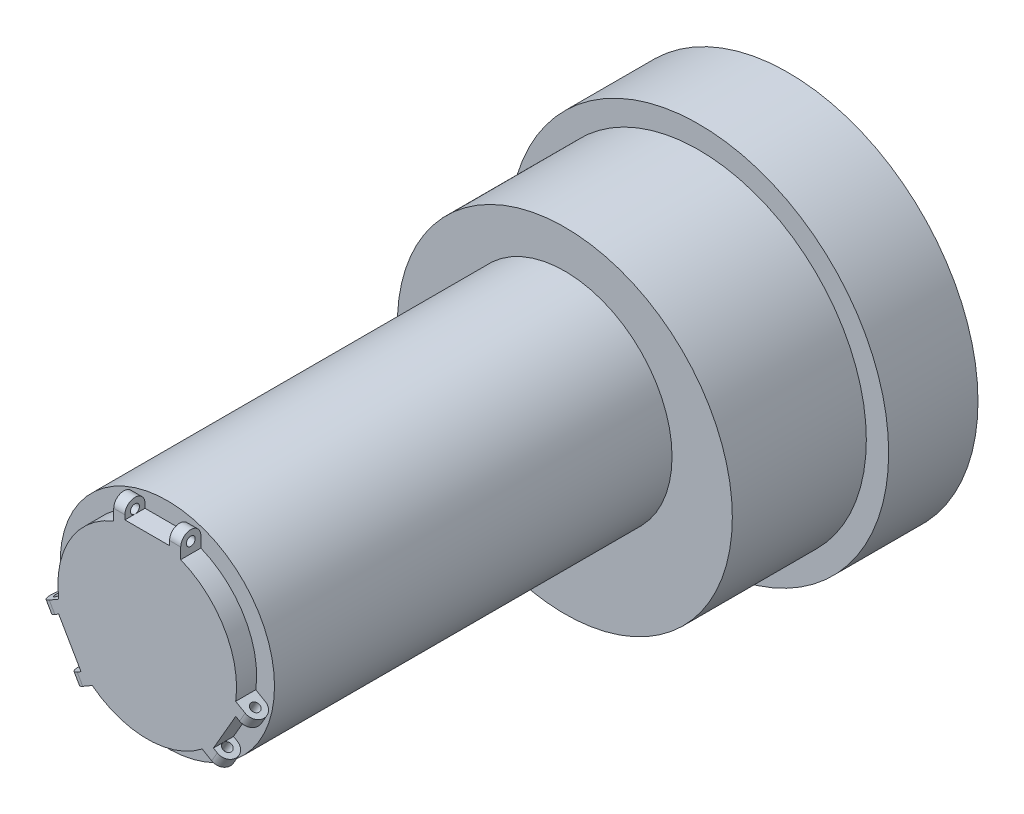
ISO-10303-21;
HEADER;
FILE_DESCRIPTION(('STEP AP214'),'2;1');
FILE_NAME('part.step','',(''),(''),'','','');
FILE_SCHEMA(('AUTOMOTIVE_DESIGN { 1 0 10303 214 1 1 1 1 }'));
ENDSEC;
DATA;
#1=APPLICATION_CONTEXT('core data for automotive mechanical design processes');
#2=APPLICATION_PROTOCOL_DEFINITION('international standard','automotive_design',2000,#1);
#3=PRODUCT_CONTEXT('',#1,'mechanical');
#4=PRODUCT('Part','Part','',(#3));
#5=PRODUCT_RELATED_PRODUCT_CATEGORY('part','',(#4));
#6=PRODUCT_DEFINITION_FORMATION('','',#4);
#7=PRODUCT_DEFINITION_CONTEXT('part definition',#1,'design');
#8=PRODUCT_DEFINITION('design','',#6,#7);
#9=PRODUCT_DEFINITION_SHAPE('','',#8);
#10=(LENGTH_UNIT() NAMED_UNIT(*) SI_UNIT(.MILLI.,.METRE.));
#11=(NAMED_UNIT(*) PLANE_ANGLE_UNIT() SI_UNIT($,.RADIAN.));
#12=(NAMED_UNIT(*) SI_UNIT($,.STERADIAN.) SOLID_ANGLE_UNIT());
#13=UNCERTAINTY_MEASURE_WITH_UNIT(LENGTH_MEASURE(1.E-05),#10,'distance_accuracy_value','');
#14=(GEOMETRIC_REPRESENTATION_CONTEXT(3) GLOBAL_UNCERTAINTY_ASSIGNED_CONTEXT((#13)) GLOBAL_UNIT_ASSIGNED_CONTEXT((#10,
#11,#12)) REPRESENTATION_CONTEXT('',''));
#15=CARTESIAN_POINT('',(0.,0.,0.));
#16=DIRECTION('',(0.,0.,1.));
#17=DIRECTION('',(1.,0.,0.));
#18=AXIS2_PLACEMENT_3D('',#15,#16,#17);
#19=CARTESIAN_POINT('',(7.49999999999999,26.,141.25));
#20=DIRECTION('',(-1.,0.,0.));
#21=DIRECTION('',(0.,-1.,0.));
#22=AXIS2_PLACEMENT_3D('',#19,#20,#21);
#23=CYLINDRICAL_SURFACE('',#22,2.25);
#24=CARTESIAN_POINT('',(-5.,26.,141.25));
#25=DIRECTION('',(-1.,0.,0.));
#26=DIRECTION('',(0.,-1.,0.));
#27=AXIS2_PLACEMENT_3D('',#24,#25,#26);
#28=CIRCLE('',#27,2.25);
#29=CARTESIAN_POINT('',(-5.,26.,139.));
#30=VERTEX_POINT('',#29);
#31=CARTESIAN_POINT('',(-5.,26.,143.5));
#32=VERTEX_POINT('',#31);
#33=EDGE_CURVE('E236',#30,#32,#28,.F.);
#34=ORIENTED_EDGE('',*,*,#33,.F.);
#35=DIRECTION('',(-1.,0.,0.));
#36=VECTOR('',#35,1.);
#37=CARTESIAN_POINT('',(7.49999999999999,26.,139.));
#38=LINE('',#37,#36);
#39=CARTESIAN_POINT('',(-7.50000000000001,26.,139.));
#40=VERTEX_POINT('',#39);
#41=EDGE_CURVE('E337',#30,#40,#38,.T.);
#42=ORIENTED_EDGE('',*,*,#41,.T.);
#43=CARTESIAN_POINT('',(-7.50000000000001,26.,141.25));
#44=DIRECTION('',(-1.,0.,0.));
#45=DIRECTION('',(0.,-1.,0.));
#46=AXIS2_PLACEMENT_3D('',#43,#44,#45);
#47=CIRCLE('',#46,2.25);
#48=CARTESIAN_POINT('',(-7.50000000000001,26.,143.5));
#49=VERTEX_POINT('',#48);
#50=EDGE_CURVE('E323',#49,#40,#47,.T.);
#51=ORIENTED_EDGE('',*,*,#50,.F.);
#52=DIRECTION('',(-1.,0.,0.));
#53=VECTOR('',#52,1.);
#54=CARTESIAN_POINT('',(7.49999999999999,26.,143.5));
#55=LINE('',#54,#53);
#56=EDGE_CURVE('E331',#32,#49,#55,.T.);
#57=ORIENTED_EDGE('',*,*,#56,.F.);
#58=EDGE_LOOP('',(#34,#42,#51,#57));
#59=FACE_BOUND('',#58,.T.);
#60=ADVANCED_FACE('F32',(#59),#23,.T.);
#61=CARTESIAN_POINT('',(42.5,26.,141.25));
#62=DIRECTION('',(-1.,0.,0.));
#63=DIRECTION('',(0.,-1.,0.));
#64=AXIS2_PLACEMENT_3D('',#61,#62,#63);
#65=CYLINDRICAL_SURFACE('',#64,0.999999999999998);
#66=CARTESIAN_POINT('',(5.,26.,141.25));
#67=DIRECTION('',(1.,0.,0.));
#68=DIRECTION('',(0.,0.,-1.));
#69=AXIS2_PLACEMENT_3D('',#66,#67,#68);
#70=CIRCLE('',#69,0.999999999999998);
#71=CARTESIAN_POINT('',(5.,25.,141.25));
#72=VERTEX_POINT('',#71);
#73=EDGE_CURVE('E11',#72,#72,#70,.F.);
#74=ORIENTED_EDGE('',*,*,#73,.T.);
#75=EDGE_LOOP('',(#74));
#76=FACE_BOUND('',#75,.T.);
#77=CARTESIAN_POINT('',(7.49999999999999,26.,141.25));
#78=DIRECTION('',(1.,0.,0.));
#79=DIRECTION('',(0.,1.,0.));
#80=AXIS2_PLACEMENT_3D('',#77,#78,#79);
#81=CIRCLE('',#80,0.999999999999998);
#82=CARTESIAN_POINT('',(7.49999999999999,27.,141.25));
#83=VERTEX_POINT('',#82);
#84=EDGE_CURVE('E310',#83,#83,#81,.T.);
#85=ORIENTED_EDGE('',*,*,#84,.T.);
#86=EDGE_LOOP('',(#85));
#87=FACE_BOUND('',#86,.T.);
#88=ADVANCED_FACE('F524',(#76,#87),#65,.F.);
#89=CARTESIAN_POINT('',(14.4365334794732,-11.9951905283833,141.25));
#90=DIRECTION('',(0.5,0.866025403784438,0.));
#91=DIRECTION('',(-0.866025403784439,0.5,0.));
#92=AXIS2_PLACEMENT_3D('',#89,#90,#91);
#93=CYLINDRICAL_SURFACE('',#92,2.24999999999997);
#94=CARTESIAN_POINT('',(20.6865334794732,-1.16987298107785,141.25));
#95=DIRECTION('',(0.5,0.866025403784439,0.));
#96=DIRECTION('',(-0.866025403784439,0.5,0.));
#97=AXIS2_PLACEMENT_3D('',#94,#95,#96);
#98=CIRCLE('',#97,2.24999999999997);
#99=CARTESIAN_POINT('',(20.6865334794732,-1.16987298107785,139.));
#100=VERTEX_POINT('',#99);
#101=CARTESIAN_POINT('',(20.6865334794732,-1.16987298107785,143.5));
#102=VERTEX_POINT('',#101);
#103=EDGE_CURVE('E268',#100,#102,#98,.F.);
#104=ORIENTED_EDGE('',*,*,#103,.F.);
#105=DIRECTION('',(0.5,0.866025403784438,0.));
#106=VECTOR('',#105,1.);
#107=CARTESIAN_POINT('',(14.4365334794732,-11.9951905283833,139.));
#108=LINE('',#107,#106);
#109=CARTESIAN_POINT('',(21.9365334794732,0.995190528383271,139.));
#110=VERTEX_POINT('',#109);
#111=EDGE_CURVE('E351',#100,#110,#108,.T.);
#112=ORIENTED_EDGE('',*,*,#111,.T.);
#113=CARTESIAN_POINT('',(21.9365334794732,0.995190528383271,141.25));
#114=DIRECTION('',(0.5,0.866025403784439,0.));
#115=DIRECTION('',(-0.866025403784438,0.5,0.));
#116=AXIS2_PLACEMENT_3D('',#113,#114,#115);
#117=CIRCLE('',#116,2.24999999999997);
#118=CARTESIAN_POINT('',(21.9365334794732,0.995190528383271,143.5));
#119=VERTEX_POINT('',#118);
#120=EDGE_CURVE('E336',#119,#110,#117,.T.);
#121=ORIENTED_EDGE('',*,*,#120,.F.);
#122=DIRECTION('',(0.5,0.866025403784438,0.));
#123=VECTOR('',#122,1.);
#124=CARTESIAN_POINT('',(14.4365334794732,-11.9951905283833,143.5));
#125=LINE('',#124,#123);
#126=EDGE_CURVE('E344',#102,#119,#125,.T.);
#127=ORIENTED_EDGE('',*,*,#126,.F.);
#128=EDGE_LOOP('',(#104,#112,#121,#127));
#129=FACE_BOUND('',#128,.T.);
#130=ADVANCED_FACE('F504',(#129),#93,.T.);
#131=CARTESIAN_POINT('',(-13.0065698604072,-59.5280398304194,141.25));
#132=DIRECTION('',(0.5,0.866025403784438,0.));
#133=DIRECTION('',(-0.866025403784439,0.5,0.));
#134=AXIS2_PLACEMENT_3D('',#131,#132,#133);
#135=CYLINDRICAL_SURFACE('',#134,1.00000000000001);
#136=CARTESIAN_POINT('',(20.6865334794732,-1.16987298107784,141.25));
#137=DIRECTION('',(0.5,0.866025403784439,0.));
#138=DIRECTION('',(-0.866025403784439,0.5,0.));
#139=AXIS2_PLACEMENT_3D('',#136,#137,#138);
#140=CIRCLE('',#139,1.00000000000001);
#141=CARTESIAN_POINT('',(19.8205080756887,-0.669872981077853,141.25));
#142=VERTEX_POINT('',#141);
#143=EDGE_CURVE('E441',#142,#142,#140,.F.);
#144=ORIENTED_EDGE('',*,*,#143,.T.);
#145=EDGE_LOOP('',(#144));
#146=FACE_BOUND('',#145,.T.);
#147=CARTESIAN_POINT('',(21.9365334794732,0.995190528383268,141.25));
#148=DIRECTION('',(0.5,0.866025403784439,0.));
#149=DIRECTION('',(-0.866025403784438,0.5,0.));
#150=AXIS2_PLACEMENT_3D('',#147,#148,#149);
#151=CIRCLE('',#150,1.00000000000001);
#152=CARTESIAN_POINT('',(21.0705080756888,1.49519052838327,141.25));
#153=VERTEX_POINT('',#152);
#154=EDGE_CURVE('E297',#153,#153,#151,.T.);
#155=ORIENTED_EDGE('',*,*,#154,.T.);
#156=EDGE_LOOP('',(#155));
#157=FACE_BOUND('',#156,.T.);
#158=ADVANCED_FACE('F547',(#146,#157),#135,.F.);
#159=CARTESIAN_POINT('',(-21.9365334794733,0.995190528383349,141.25));
#160=DIRECTION('',(0.5,-0.866025403784439,0.));
#161=DIRECTION('',(0.866025403784439,0.5,0.));
#162=AXIS2_PLACEMENT_3D('',#159,#160,#161);
#163=CYLINDRICAL_SURFACE('',#162,2.25000000000003);
#164=CARTESIAN_POINT('',(-15.6865334794733,-9.83012701892214,141.25));
#165=DIRECTION('',(0.5,-0.866025403784439,0.));
#166=DIRECTION('',(0.866025403784439,0.5,0.));
#167=AXIS2_PLACEMENT_3D('',#164,#165,#166);
#168=CIRCLE('',#167,2.25000000000003);
#169=CARTESIAN_POINT('',(-15.6865334794733,-9.83012701892215,139.));
#170=VERTEX_POINT('',#169);
#171=CARTESIAN_POINT('',(-15.6865334794733,-9.83012701892214,143.5));
#172=VERTEX_POINT('',#171);
#173=EDGE_CURVE('E295',#170,#172,#168,.F.);
#174=ORIENTED_EDGE('',*,*,#173,.F.);
#175=DIRECTION('',(0.5,-0.866025403784439,0.));
#176=VECTOR('',#175,1.);
#177=CARTESIAN_POINT('',(-21.9365334794733,0.995190528383349,139.));
#178=LINE('',#177,#176);
#179=CARTESIAN_POINT('',(-14.4365334794733,-11.9951905283832,139.));
#180=VERTEX_POINT('',#179);
#181=EDGE_CURVE('E324',#170,#180,#178,.T.);
#182=ORIENTED_EDGE('',*,*,#181,.T.);
#183=CARTESIAN_POINT('',(-14.4365334794733,-11.9951905283832,141.25));
#184=DIRECTION('',(0.5,-0.866025403784439,0.));
#185=DIRECTION('',(0.866025403784439,0.5,0.));
#186=AXIS2_PLACEMENT_3D('',#183,#184,#185);
#187=CIRCLE('',#186,2.25000000000003);
#188=CARTESIAN_POINT('',(-14.4365334794733,-11.9951905283832,143.5));
#189=VERTEX_POINT('',#188);
#190=EDGE_CURVE('E313',#189,#180,#187,.T.);
#191=ORIENTED_EDGE('',*,*,#190,.F.);
#192=DIRECTION('',(0.5,-0.866025403784439,0.));
#193=VECTOR('',#192,1.);
#194=CARTESIAN_POINT('',(-21.9365334794733,0.995190528383349,143.5));
#195=LINE('',#194,#193);
#196=EDGE_CURVE('E317',#172,#189,#195,.T.);
#197=ORIENTED_EDGE('',*,*,#196,.F.);
#198=EDGE_LOOP('',(#174,#182,#191,#197));
#199=FACE_BOUND('',#198,.T.);
#200=ADVANCED_FACE('F540',(#199),#163,.T.);
#201=CARTESIAN_POINT('',(-45.0495098004315,41.0280398304193,141.25));
#202=DIRECTION('',(0.5,-0.866025403784439,0.));
#203=DIRECTION('',(0.866025403784439,0.5,0.));
#204=AXIS2_PLACEMENT_3D('',#201,#202,#203);
#205=CYLINDRICAL_SURFACE('',#204,0.999999999999999);
#206=CARTESIAN_POINT('',(-15.6865334794733,-9.83012701892215,141.25));
#207=DIRECTION('',(0.5,-0.866025403784439,0.));
#208=DIRECTION('',(0.866025403784439,0.5,0.));
#209=AXIS2_PLACEMENT_3D('',#206,#207,#208);
#210=CIRCLE('',#209,0.999999999999999);
#211=CARTESIAN_POINT('',(-14.8205080756888,-9.33012701892214,141.25));
#212=VERTEX_POINT('',#211);
#213=EDGE_CURVE('E435',#212,#212,#210,.F.);
#214=ORIENTED_EDGE('',*,*,#213,.T.);
#215=EDGE_LOOP('',(#214));
#216=FACE_BOUND('',#215,.T.);
#217=CARTESIAN_POINT('',(-14.4365334794733,-11.9951905283832,141.25));
#218=DIRECTION('',(0.5,-0.866025403784439,0.));
#219=DIRECTION('',(0.866025403784439,0.5,0.));
#220=AXIS2_PLACEMENT_3D('',#217,#218,#219);
#221=CIRCLE('',#220,0.999999999999999);
#222=CARTESIAN_POINT('',(-13.5705080756888,-11.4951905283832,141.25));
#223=VERTEX_POINT('',#222);
#224=EDGE_CURVE('E303',#223,#223,#221,.T.);
#225=ORIENTED_EDGE('',*,*,#224,.T.);
#226=EDGE_LOOP('',(#225));
#227=FACE_BOUND('',#226,.T.);
#228=ADVANCED_FACE('F546',(#216,#227),#205,.F.);
#229=CARTESIAN_POINT('',(0.,5.00000000000001,139.));
#230=DIRECTION('',(0.,0.,1.));
#231=DIRECTION('',(1.,0.,0.));
#232=AXIS2_PLACEMENT_3D('',#229,#230,#231);
#233=PLANE('',#232);
#234=ORIENTED_EDGE('',*,*,#41,.F.);
#235=DIRECTION('',(0.,1.,0.));
#236=VECTOR('',#235,1.);
#237=CARTESIAN_POINT('',(-5.,25.,139.));
#238=LINE('',#237,#236);
#239=CARTESIAN_POINT('',(-5.,25.,139.));
#240=VERTEX_POINT('',#239);
#241=EDGE_CURVE('E221',#240,#30,#238,.T.);
#242=ORIENTED_EDGE('',*,*,#241,.F.);
#243=DIRECTION('',(-1.,0.,0.));
#244=VECTOR('',#243,1.);
#245=CARTESIAN_POINT('',(-5.,25.,139.));
#246=LINE('',#245,#244);
#247=CARTESIAN_POINT('',(5.,25.,139.));
#248=VERTEX_POINT('',#247);
#249=EDGE_CURVE('E213',#248,#240,#246,.T.);
#250=ORIENTED_EDGE('',*,*,#249,.F.);
#251=DIRECTION('',(0.,1.,0.));
#252=VECTOR('',#251,1.);
#253=CARTESIAN_POINT('',(5.,25.,139.));
#254=LINE('',#253,#252);
#255=CARTESIAN_POINT('',(5.,26.,139.));
#256=VERTEX_POINT('',#255);
#257=EDGE_CURVE('E216',#248,#256,#254,.T.);
#258=ORIENTED_EDGE('',*,*,#257,.T.);
#259=CARTESIAN_POINT('',(7.49999999999999,26.,139.));
#260=VERTEX_POINT('',#259);
#261=EDGE_CURVE('E334',#260,#256,#38,.T.);
#262=ORIENTED_EDGE('',*,*,#261,.F.);
#263=DIRECTION('',(0.,1.,0.));
#264=VECTOR('',#263,1.);
#265=CARTESIAN_POINT('',(7.49999999999999,15.,139.));
#266=LINE('',#265,#264);
#267=CARTESIAN_POINT('',(7.49999999999999,23.5404962177392,139.));
#268=VERTEX_POINT('',#267);
#269=EDGE_CURVE('E386',#268,#260,#266,.T.);
#270=ORIENTED_EDGE('',*,*,#269,.F.);
#271=CARTESIAN_POINT('',(0.,5.00000000000001,139.));
#272=DIRECTION('',(0.,0.,1.));
#273=DIRECTION('',(1.,0.,0.));
#274=AXIS2_PLACEMENT_3D('',#271,#272,#273);
#275=CIRCLE('',#274,20.);
#276=CARTESIAN_POINT('',(19.8065407233314,2.2249424195137,139.));
#277=VERTEX_POINT('',#276);
#278=EDGE_CURVE('E413',#277,#268,#275,.T.);
#279=ORIENTED_EDGE('',*,*,#278,.F.);
#280=DIRECTION('',(0.866025403784439,-0.5,0.));
#281=VECTOR('',#280,1.);
#282=CARTESIAN_POINT('',(12.4102540378444,6.49519052838327,139.));
#283=LINE('',#282,#281);
#284=EDGE_CURVE('E350',#277,#110,#283,.T.);
#285=ORIENTED_EDGE('',*,*,#284,.T.);
#286=ORIENTED_EDGE('',*,*,#111,.F.);
#287=DIRECTION('',(0.866025403784439,-0.5,0.));
#288=VECTOR('',#287,1.);
#289=CARTESIAN_POINT('',(19.8205080756887,-0.66987298107784,139.));
#290=LINE('',#289,#288);
#291=CARTESIAN_POINT('',(19.8205080756887,-0.66987298107784,139.));
#292=VERTEX_POINT('',#291);
#293=EDGE_CURVE('E260',#292,#100,#290,.T.);
#294=ORIENTED_EDGE('',*,*,#293,.F.);
#295=DIRECTION('',(0.5,0.866025403784439,0.));
#296=VECTOR('',#295,1.);
#297=CARTESIAN_POINT('',(19.8205080756887,-0.66987298107784,139.));
#298=LINE('',#297,#296);
#299=CARTESIAN_POINT('',(14.8205080756887,-9.33012701892223,139.));
#300=VERTEX_POINT('',#299);
#301=EDGE_CURVE('E249',#300,#292,#298,.T.);
#302=ORIENTED_EDGE('',*,*,#301,.F.);
#303=DIRECTION('',(0.866025403784439,-0.5,0.));
#304=VECTOR('',#303,1.);
#305=CARTESIAN_POINT('',(14.8205080756887,-9.33012701892223,139.));
#306=LINE('',#305,#304);
#307=CARTESIAN_POINT('',(15.6865334794732,-9.83012701892224,139.));
#308=VERTEX_POINT('',#307);
#309=EDGE_CURVE('E262',#300,#308,#306,.T.);
#310=ORIENTED_EDGE('',*,*,#309,.T.);
#311=CARTESIAN_POINT('',(14.4365334794732,-11.9951905283833,139.));
#312=VERTEX_POINT('',#311);
#313=EDGE_CURVE('E347',#312,#308,#108,.T.);
#314=ORIENTED_EDGE('',*,*,#313,.F.);
#315=DIRECTION('',(0.866025403784439,-0.5,0.));
#316=VECTOR('',#315,1.);
#317=CARTESIAN_POINT('',(4.91025403784438,-6.4951905283833,139.));
#318=LINE('',#317,#316);
#319=CARTESIAN_POINT('',(12.3065407233314,-10.7654386372529,139.));
#320=VERTEX_POINT('',#319);
#321=EDGE_CURVE('E355',#320,#312,#318,.T.);
#322=ORIENTED_EDGE('',*,*,#321,.F.);
#323=CARTESIAN_POINT('',(-12.3065407233315,-10.7654386372528,139.));
#324=VERTEX_POINT('',#323);
#325=EDGE_CURVE('E412',#324,#320,#275,.T.);
#326=ORIENTED_EDGE('',*,*,#325,.F.);
#327=DIRECTION('',(-0.866025403784439,-0.5,0.));
#328=VECTOR('',#327,1.);
#329=CARTESIAN_POINT('',(-4.91025403784443,-6.49519052838323,139.));
#330=LINE('',#329,#328);
#331=EDGE_CURVE('E375',#324,#180,#330,.T.);
#332=ORIENTED_EDGE('',*,*,#331,.T.);
#333=ORIENTED_EDGE('',*,*,#181,.F.);
#334=DIRECTION('',(-0.866025403784439,-0.5,0.));
#335=VECTOR('',#334,1.);
#336=CARTESIAN_POINT('',(-14.8205080756888,-9.33012701892214,139.));
#337=LINE('',#336,#335);
#338=CARTESIAN_POINT('',(-14.8205080756888,-9.33012701892214,139.));
#339=VERTEX_POINT('',#338);
#340=EDGE_CURVE('E287',#339,#170,#337,.T.);
#341=ORIENTED_EDGE('',*,*,#340,.F.);
#342=DIRECTION('',(0.5,-0.866025403784439,0.));
#343=VECTOR('',#342,1.);
#344=CARTESIAN_POINT('',(-19.8205080756888,-0.669872981077756,139.));
#345=LINE('',#344,#343);
#346=CARTESIAN_POINT('',(-19.8205080756888,-0.669872981077756,139.));
#347=VERTEX_POINT('',#346);
#348=EDGE_CURVE('E276',#347,#339,#345,.T.);
#349=ORIENTED_EDGE('',*,*,#348,.F.);
#350=DIRECTION('',(-0.866025403784439,-0.5,0.));
#351=VECTOR('',#350,1.);
#352=CARTESIAN_POINT('',(-19.8205080756888,-0.669872981077756,139.));
#353=LINE('',#352,#351);
#354=CARTESIAN_POINT('',(-20.6865334794733,-1.16987298107776,139.));
#355=VERTEX_POINT('',#354);
#356=EDGE_CURVE('E289',#347,#355,#353,.T.);
#357=ORIENTED_EDGE('',*,*,#356,.T.);
#358=CARTESIAN_POINT('',(-21.9365334794733,0.995190528383349,139.));
#359=VERTEX_POINT('',#358);
#360=EDGE_CURVE('E320',#359,#355,#178,.T.);
#361=ORIENTED_EDGE('',*,*,#360,.F.);
#362=DIRECTION('',(-0.866025403784439,-0.5,0.));
#363=VECTOR('',#362,1.);
#364=CARTESIAN_POINT('',(-12.4102540378444,6.49519052838335,139.));
#365=LINE('',#364,#363);
#366=CARTESIAN_POINT('',(-19.8065407233314,2.22494241951379,139.));
#367=VERTEX_POINT('',#366);
#368=EDGE_CURVE('E378',#367,#359,#365,.T.);
#369=ORIENTED_EDGE('',*,*,#368,.F.);
#370=CARTESIAN_POINT('',(-7.50000000000001,23.5404962177392,139.));
#371=VERTEX_POINT('',#370);
#372=EDGE_CURVE('E408',#371,#367,#275,.T.);
#373=ORIENTED_EDGE('',*,*,#372,.F.);
#374=DIRECTION('',(0.,1.,0.));
#375=VECTOR('',#374,1.);
#376=CARTESIAN_POINT('',(-7.50000000000001,15.,139.));
#377=LINE('',#376,#375);
#378=EDGE_CURVE('E393',#371,#40,#377,.T.);
#379=ORIENTED_EDGE('',*,*,#378,.T.);
#380=EDGE_LOOP('',(#234,#242,#250,#258,#262,#270,#279,#285,#286,#294,#302,#310,#314,#322,#326,
#332,#333,#341,#349,#357,#361,#369,#373,#379));
#381=FACE_BOUND('',#380,.T.);
#382=CARTESIAN_POINT('',(0.,5.00000000000001,139.));
#383=DIRECTION('',(0.,0.,1.));
#384=DIRECTION('',(1.,0.,0.));
#385=AXIS2_PLACEMENT_3D('',#382,#383,#384);
#386=CIRCLE('',#385,24.);
#387=CARTESIAN_POINT('',(24.,5.00000000000001,139.));
#388=VERTEX_POINT('',#387);
#389=EDGE_CURVE('E406',#388,#388,#386,.T.);
#390=ORIENTED_EDGE('',*,*,#389,.T.);
#391=EDGE_LOOP('',(#390));
#392=FACE_BOUND('',#391,.T.);
#393=ADVANCED_FACE('F225',(#381,#392),#233,.T.);
#394=CARTESIAN_POINT('',(0.,5.00000000000001,143.5));
#395=DIRECTION('',(0.,0.,-1.));
#396=DIRECTION('',(-1.,0.,0.));
#397=AXIS2_PLACEMENT_3D('',#394,#395,#396);
#398=CYLINDRICAL_SURFACE('',#397,20.);
#399=ORIENTED_EDGE('',*,*,#325,.T.);
#400=DIRECTION('',(0.,0.,-1.));
#401=VECTOR('',#400,1.);
#402=CARTESIAN_POINT('',(12.3065407233314,-10.7654386372529,143.5));
#403=LINE('',#402,#401);
#404=CARTESIAN_POINT('',(12.3065407233314,-10.7654386372529,143.5));
#405=VERTEX_POINT('',#404);
#406=EDGE_CURVE('E367',#320,#405,#403,.F.);
#407=ORIENTED_EDGE('',*,*,#406,.T.);
#408=CARTESIAN_POINT('',(0.,5.00000000000001,143.5));
#409=DIRECTION('',(0.,0.,1.));
#410=DIRECTION('',(1.,0.,0.));
#411=AXIS2_PLACEMENT_3D('',#408,#409,#410);
#412=CIRCLE('',#411,20.);
#413=CARTESIAN_POINT('',(-12.3065407233315,-10.7654386372528,143.5));
#414=VERTEX_POINT('',#413);
#415=EDGE_CURVE('E407',#414,#405,#412,.T.);
#416=ORIENTED_EDGE('',*,*,#415,.F.);
#417=DIRECTION('',(0.,0.,-1.));
#418=VECTOR('',#417,1.);
#419=CARTESIAN_POINT('',(-12.3065407233315,-10.7654386372528,143.5));
#420=LINE('',#419,#418);
#421=EDGE_CURVE('E383',#414,#324,#420,.T.);
#422=ORIENTED_EDGE('',*,*,#421,.T.);
#423=EDGE_LOOP('',(#399,#407,#416,#422));
#424=FACE_BOUND('',#423,.T.);
#425=ADVANCED_FACE('F472',(#424),#398,.T.);
#426=ORIENTED_EDGE('',*,*,#372,.T.);
#427=DIRECTION('',(0.,0.,-1.));
#428=VECTOR('',#427,1.);
#429=CARTESIAN_POINT('',(-19.8065407233314,2.22494241951379,143.5));
#430=LINE('',#429,#428);
#431=CARTESIAN_POINT('',(-19.8065407233314,2.22494241951379,143.5));
#432=VERTEX_POINT('',#431);
#433=EDGE_CURVE('E374',#367,#432,#430,.F.);
#434=ORIENTED_EDGE('',*,*,#433,.T.);
#435=CARTESIAN_POINT('',(-7.50000000000001,23.5404962177392,143.5));
#436=VERTEX_POINT('',#435);
#437=EDGE_CURVE('E403',#436,#432,#412,.T.);
#438=ORIENTED_EDGE('',*,*,#437,.F.);
#439=DIRECTION('',(0.,0.,-1.));
#440=VECTOR('',#439,1.);
#441=CARTESIAN_POINT('',(-7.50000000000001,23.5404962177392,143.5));
#442=LINE('',#441,#440);
#443=EDGE_CURVE('E389',#436,#371,#442,.T.);
#444=ORIENTED_EDGE('',*,*,#443,.T.);
#445=EDGE_LOOP('',(#426,#434,#438,#444));
#446=FACE_BOUND('',#445,.T.);
#447=ADVANCED_FACE('F591',(#446),#398,.T.);
#448=CARTESIAN_POINT('',(0.,0.,20.));
#449=DIRECTION('',(0.,0.,-1.));
#450=DIRECTION('',(-1.,0.,0.));
#451=AXIS2_PLACEMENT_3D('',#448,#449,#450);
#452=CYLINDRICAL_SURFACE('',#451,42.5);
#453=CARTESIAN_POINT('',(0.,0.,20.));
#454=DIRECTION('',(0.,0.,1.));
#455=DIRECTION('',(1.,0.,0.));
#456=AXIS2_PLACEMENT_3D('',#453,#454,#455);
#457=CIRCLE('',#456,42.5);
#458=CARTESIAN_POINT('',(42.5,0.,20.));
#459=VERTEX_POINT('',#458);
#460=EDGE_CURVE('E426',#459,#459,#457,.T.);
#461=ORIENTED_EDGE('',*,*,#460,.F.);
#462=EDGE_LOOP('',(#461));
#463=FACE_BOUND('',#462,.T.);
#464=CARTESIAN_POINT('',(0.,0.,0.));
#465=DIRECTION('',(0.,0.,1.));
#466=DIRECTION('',(1.,0.,0.));
#467=AXIS2_PLACEMENT_3D('',#464,#465,#466);
#468=CIRCLE('',#467,42.5);
#469=CARTESIAN_POINT('',(42.5,0.,0.));
#470=VERTEX_POINT('',#469);
#471=EDGE_CURVE('E423',#470,#470,#468,.T.);
#472=ORIENTED_EDGE('',*,*,#471,.T.);
#473=EDGE_LOOP('',(#472));
#474=FACE_BOUND('',#473,.T.);
#475=ADVANCED_FACE('F34',(#463,#474),#452,.T.);
#476=CARTESIAN_POINT('',(0.,0.,20.));
#477=DIRECTION('',(0.,0.,1.));
#478=DIRECTION('',(1.,0.,0.));
#479=AXIS2_PLACEMENT_3D('',#476,#477,#478);
#480=PLANE('',#479);
#481=CARTESIAN_POINT('',(0.,0.,20.));
#482=DIRECTION('',(0.,0.,1.));
#483=DIRECTION('',(1.,0.,0.));
#484=AXIS2_PLACEMENT_3D('',#481,#482,#483);
#485=CIRCLE('',#484,37.5);
#486=CARTESIAN_POINT('',(37.5,0.,20.));
#487=VERTEX_POINT('',#486);
#488=EDGE_CURVE('E420',#487,#487,#485,.T.);
#489=ORIENTED_EDGE('',*,*,#488,.F.);
#490=EDGE_LOOP('',(#489));
#491=FACE_BOUND('',#490,.T.);
#492=ORIENTED_EDGE('',*,*,#460,.T.);
#493=EDGE_LOOP('',(#492));
#494=FACE_BOUND('',#493,.T.);
#495=ADVANCED_FACE('F627',(#491,#494),#480,.T.);
#496=CARTESIAN_POINT('',(0.,0.,0.));
#497=DIRECTION('',(0.,0.,1.));
#498=DIRECTION('',(1.,0.,0.));
#499=AXIS2_PLACEMENT_3D('',#496,#497,#498);
#500=PLANE('',#499);
#501=ORIENTED_EDGE('',*,*,#471,.F.);
#502=EDGE_LOOP('',(#501));
#503=FACE_BOUND('',#502,.T.);
#504=ADVANCED_FACE('F625',(#503),#500,.F.);
#505=CARTESIAN_POINT('',(0.,0.,50.));
#506=DIRECTION('',(0.,0.,-1.));
#507=DIRECTION('',(-1.,0.,0.));
#508=AXIS2_PLACEMENT_3D('',#505,#506,#507);
#509=CYLINDRICAL_SURFACE('',#508,37.5);
#510=CARTESIAN_POINT('',(0.,0.,50.));
#511=DIRECTION('',(0.,0.,1.));
#512=DIRECTION('',(1.,0.,0.));
#513=AXIS2_PLACEMENT_3D('',#510,#511,#512);
#514=CIRCLE('',#513,37.5);
#515=CARTESIAN_POINT('',(37.5,0.,50.));
#516=VERTEX_POINT('',#515);
#517=EDGE_CURVE('E416',#516,#516,#514,.T.);
#518=ORIENTED_EDGE('',*,*,#517,.F.);
#519=EDGE_LOOP('',(#518));
#520=FACE_BOUND('',#519,.T.);
#521=ORIENTED_EDGE('',*,*,#488,.T.);
#522=EDGE_LOOP('',(#521));
#523=FACE_BOUND('',#522,.T.);
#524=ADVANCED_FACE('F621',(#520,#523),#509,.T.);
#525=CARTESIAN_POINT('',(0.,0.,50.));
#526=DIRECTION('',(0.,0.,1.));
#527=DIRECTION('',(1.,0.,0.));
#528=AXIS2_PLACEMENT_3D('',#525,#526,#527);
#529=PLANE('',#528);
#530=CARTESIAN_POINT('',(0.,5.00000000000001,50.));
#531=DIRECTION('',(0.,0.,1.));
#532=DIRECTION('',(1.,0.,0.));
#533=AXIS2_PLACEMENT_3D('',#530,#531,#532);
#534=CIRCLE('',#533,24.);
#535=CARTESIAN_POINT('',(24.,5.00000000000001,50.));
#536=VERTEX_POINT('',#535);
#537=EDGE_CURVE('E417',#536,#536,#534,.T.);
#538=ORIENTED_EDGE('',*,*,#537,.F.);
#539=EDGE_LOOP('',(#538));
#540=FACE_BOUND('',#539,.T.);
#541=ORIENTED_EDGE('',*,*,#517,.T.);
#542=EDGE_LOOP('',(#541));
#543=FACE_BOUND('',#542,.T.);
#544=ADVANCED_FACE('F617',(#540,#543),#529,.T.);
#545=CARTESIAN_POINT('',(0.,5.00000000000001,139.));
#546=DIRECTION('',(0.,0.,-1.));
#547=DIRECTION('',(-1.,0.,0.));
#548=AXIS2_PLACEMENT_3D('',#545,#546,#547);
#549=CYLINDRICAL_SURFACE('',#548,24.);
#550=ORIENTED_EDGE('',*,*,#389,.F.);
#551=EDGE_LOOP('',(#550));
#552=FACE_BOUND('',#551,.T.);
#553=ORIENTED_EDGE('',*,*,#537,.T.);
#554=EDGE_LOOP('',(#553));
#555=FACE_BOUND('',#554,.T.);
#556=ADVANCED_FACE('F612',(#552,#555),#549,.T.);
#557=CARTESIAN_POINT('',(19.8065407233314,2.22494241951369,143.5));
#558=VERTEX_POINT('',#557);
#559=CARTESIAN_POINT('',(7.49999999999999,23.5404962177392,143.5));
#560=VERTEX_POINT('',#559);
#561=EDGE_CURVE('E402',#558,#560,#412,.T.);
#562=ORIENTED_EDGE('',*,*,#561,.F.);
#563=DIRECTION('',(0.,0.,-1.));
#564=VECTOR('',#563,1.);
#565=CARTESIAN_POINT('',(19.8065407233314,2.2249424195137,143.5));
#566=LINE('',#565,#564);
#567=EDGE_CURVE('E357',#558,#277,#566,.T.);
#568=ORIENTED_EDGE('',*,*,#567,.T.);
#569=ORIENTED_EDGE('',*,*,#278,.T.);
#570=DIRECTION('',(0.,0.,-1.));
#571=VECTOR('',#570,1.);
#572=CARTESIAN_POINT('',(7.49999999999999,23.5404962177392,143.5));
#573=LINE('',#572,#571);
#574=EDGE_CURVE('E399',#268,#560,#573,.F.);
#575=ORIENTED_EDGE('',*,*,#574,.T.);
#576=EDGE_LOOP('',(#562,#568,#569,#575));
#577=FACE_BOUND('',#576,.T.);
#578=ADVANCED_FACE('F468',(#577),#398,.T.);
#579=CARTESIAN_POINT('',(0.,5.00000000000001,143.5));
#580=DIRECTION('',(0.,0.,1.));
#581=DIRECTION('',(1.,0.,0.));
#582=AXIS2_PLACEMENT_3D('',#579,#580,#581);
#583=PLANE('',#582);
#584=DIRECTION('',(0.,1.,0.));
#585=VECTOR('',#584,1.);
#586=CARTESIAN_POINT('',(5.,25.,143.5));
#587=LINE('',#586,#585);
#588=CARTESIAN_POINT('',(5.,25.,143.5));
#589=VERTEX_POINT('',#588);
#590=CARTESIAN_POINT('',(5.,26.,143.5));
#591=VERTEX_POINT('',#590);
#592=EDGE_CURVE('E234',#589,#591,#587,.T.);
#593=ORIENTED_EDGE('',*,*,#592,.F.);
#594=DIRECTION('',(1.,0.,0.));
#595=VECTOR('',#594,1.);
#596=CARTESIAN_POINT('',(-5.,25.,143.5));
#597=LINE('',#596,#595);
#598=CARTESIAN_POINT('',(-5.,25.,143.5));
#599=VERTEX_POINT('',#598);
#600=EDGE_CURVE('E222',#599,#589,#597,.T.);
#601=ORIENTED_EDGE('',*,*,#600,.F.);
#602=DIRECTION('',(0.,1.,0.));
#603=VECTOR('',#602,1.);
#604=CARTESIAN_POINT('',(-5.,25.,143.5));
#605=LINE('',#604,#603);
#606=EDGE_CURVE('E237',#599,#32,#605,.T.);
#607=ORIENTED_EDGE('',*,*,#606,.T.);
#608=ORIENTED_EDGE('',*,*,#56,.T.);
#609=DIRECTION('',(0.,1.,0.));
#610=VECTOR('',#609,1.);
#611=CARTESIAN_POINT('',(-7.50000000000001,15.,143.5));
#612=LINE('',#611,#610);
#613=EDGE_CURVE('E390',#436,#49,#612,.T.);
#614=ORIENTED_EDGE('',*,*,#613,.F.);
#615=ORIENTED_EDGE('',*,*,#437,.T.);
#616=DIRECTION('',(-0.866025403784439,-0.5,0.));
#617=VECTOR('',#616,1.);
#618=CARTESIAN_POINT('',(-12.4102540378444,6.49519052838335,143.5));
#619=LINE('',#618,#617);
#620=CARTESIAN_POINT('',(-21.9365334794733,0.995190528383349,143.5));
#621=VERTEX_POINT('',#620);
#622=EDGE_CURVE('E370',#432,#621,#619,.T.);
#623=ORIENTED_EDGE('',*,*,#622,.T.);
#624=CARTESIAN_POINT('',(-20.6865334794733,-1.16987298107776,143.5));
#625=VERTEX_POINT('',#624);
#626=EDGE_CURVE('E325',#621,#625,#195,.T.);
#627=ORIENTED_EDGE('',*,*,#626,.T.);
#628=DIRECTION('',(-0.866025403784439,-0.5,0.));
#629=VECTOR('',#628,1.);
#630=CARTESIAN_POINT('',(-19.8205080756888,-0.669872981077756,143.5));
#631=LINE('',#630,#629);
#632=CARTESIAN_POINT('',(-19.8205080756888,-0.669872981077756,143.5));
#633=VERTEX_POINT('',#632);
#634=EDGE_CURVE('E282',#633,#625,#631,.T.);
#635=ORIENTED_EDGE('',*,*,#634,.F.);
#636=DIRECTION('',(-0.5,0.866025403784439,0.));
#637=VECTOR('',#636,1.);
#638=CARTESIAN_POINT('',(-19.8205080756888,-0.669872981077756,143.5));
#639=LINE('',#638,#637);
#640=CARTESIAN_POINT('',(-14.8205080756888,-9.33012701892214,143.5));
#641=VERTEX_POINT('',#640);
#642=EDGE_CURVE('E270',#641,#633,#639,.T.);
#643=ORIENTED_EDGE('',*,*,#642,.F.);
#644=DIRECTION('',(-0.866025403784439,-0.5,0.));
#645=VECTOR('',#644,1.);
#646=CARTESIAN_POINT('',(-14.8205080756888,-9.33012701892214,143.5));
#647=LINE('',#646,#645);
#648=EDGE_CURVE('E283',#641,#172,#647,.T.);
#649=ORIENTED_EDGE('',*,*,#648,.T.);
#650=ORIENTED_EDGE('',*,*,#196,.T.);
#651=DIRECTION('',(-0.866025403784439,-0.5,0.));
#652=VECTOR('',#651,1.);
#653=CARTESIAN_POINT('',(-4.91025403784443,-6.49519052838323,143.5));
#654=LINE('',#653,#652);
#655=EDGE_CURVE('E371',#414,#189,#654,.T.);
#656=ORIENTED_EDGE('',*,*,#655,.F.);
#657=ORIENTED_EDGE('',*,*,#415,.T.);
#658=DIRECTION('',(0.866025403784439,-0.5,0.));
#659=VECTOR('',#658,1.);
#660=CARTESIAN_POINT('',(4.91025403784438,-6.4951905283833,143.5));
#661=LINE('',#660,#659);
#662=CARTESIAN_POINT('',(14.4365334794732,-11.9951905283833,143.5));
#663=VERTEX_POINT('',#662);
#664=EDGE_CURVE('E358',#405,#663,#661,.T.);
#665=ORIENTED_EDGE('',*,*,#664,.T.);
#666=CARTESIAN_POINT('',(15.6865334794732,-9.83012701892224,143.5));
#667=VERTEX_POINT('',#666);
#668=EDGE_CURVE('E352',#663,#667,#125,.T.);
#669=ORIENTED_EDGE('',*,*,#668,.T.);
#670=DIRECTION('',(0.866025403784439,-0.5,0.));
#671=VECTOR('',#670,1.);
#672=CARTESIAN_POINT('',(14.8205080756887,-9.33012701892223,143.5));
#673=LINE('',#672,#671);
#674=CARTESIAN_POINT('',(14.8205080756887,-9.33012701892223,143.5));
#675=VERTEX_POINT('',#674);
#676=EDGE_CURVE('E255',#675,#667,#673,.T.);
#677=ORIENTED_EDGE('',*,*,#676,.F.);
#678=DIRECTION('',(-0.5,-0.866025403784439,0.));
#679=VECTOR('',#678,1.);
#680=CARTESIAN_POINT('',(19.8205080756887,-0.669872981077843,143.5));
#681=LINE('',#680,#679);
#682=CARTESIAN_POINT('',(19.8205080756887,-0.669872981077843,143.5));
#683=VERTEX_POINT('',#682);
#684=EDGE_CURVE('E243',#683,#675,#681,.T.);
#685=ORIENTED_EDGE('',*,*,#684,.F.);
#686=DIRECTION('',(0.866025403784439,-0.5,0.));
#687=VECTOR('',#686,1.);
#688=CARTESIAN_POINT('',(19.8205080756887,-0.669872981077843,143.5));
#689=LINE('',#688,#687);
#690=EDGE_CURVE('E256',#683,#102,#689,.T.);
#691=ORIENTED_EDGE('',*,*,#690,.T.);
#692=ORIENTED_EDGE('',*,*,#126,.T.);
#693=DIRECTION('',(0.866025403784439,-0.5,0.));
#694=VECTOR('',#693,1.);
#695=CARTESIAN_POINT('',(12.4102540378444,6.49519052838327,143.5));
#696=LINE('',#695,#694);
#697=EDGE_CURVE('E360',#558,#119,#696,.T.);
#698=ORIENTED_EDGE('',*,*,#697,.F.);
#699=ORIENTED_EDGE('',*,*,#561,.T.);
#700=DIRECTION('',(0.,1.,0.));
#701=VECTOR('',#700,1.);
#702=CARTESIAN_POINT('',(7.49999999999999,15.,143.5));
#703=LINE('',#702,#701);
#704=CARTESIAN_POINT('',(7.49999999999999,26.,143.5));
#705=VERTEX_POINT('',#704);
#706=EDGE_CURVE('E387',#560,#705,#703,.T.);
#707=ORIENTED_EDGE('',*,*,#706,.T.);
#708=EDGE_CURVE('E338',#705,#591,#55,.T.);
#709=ORIENTED_EDGE('',*,*,#708,.T.);
#710=EDGE_LOOP('',(#593,#601,#607,#608,#614,#615,#623,#627,#635,#643,#649,#650,#656,#657,#665,
#669,#677,#685,#691,#692,#698,#699,#707,#709));
#711=FACE_BOUND('',#710,.T.);
#712=ADVANCED_FACE('F455',(#711),#583,.T.);
#713=CARTESIAN_POINT('',(7.49999999999999,15.,139.));
#714=DIRECTION('',(1.,0.,0.));
#715=DIRECTION('',(0.,1.,0.));
#716=AXIS2_PLACEMENT_3D('',#713,#714,#715);
#717=PLANE('',#716);
#718=ORIENTED_EDGE('',*,*,#84,.F.);
#719=EDGE_LOOP('',(#718));
#720=FACE_BOUND('',#719,.T.);
#721=ORIENTED_EDGE('',*,*,#574,.F.);
#722=ORIENTED_EDGE('',*,*,#269,.T.);
#723=CARTESIAN_POINT('',(7.49999999999999,26.,141.25));
#724=DIRECTION('',(-1.,0.,0.));
#725=DIRECTION('',(0.,-1.,0.));
#726=AXIS2_PLACEMENT_3D('',#723,#724,#725);
#727=CIRCLE('',#726,2.25);
#728=EDGE_CURVE('E328',#705,#260,#727,.T.);
#729=ORIENTED_EDGE('',*,*,#728,.F.);
#730=ORIENTED_EDGE('',*,*,#706,.F.);
#731=EDGE_LOOP('',(#721,#722,#729,#730));
#732=FACE_BOUND('',#731,.T.);
#733=ADVANCED_FACE('F464',(#720,#732),#717,.T.);
#734=CARTESIAN_POINT('',(-7.50000000000001,15.,139.));
#735=DIRECTION('',(-1.,0.,0.));
#736=DIRECTION('',(0.,-1.,0.));
#737=AXIS2_PLACEMENT_3D('',#734,#735,#736);
#738=PLANE('',#737);
#739=CARTESIAN_POINT('',(-7.50000000000001,26.,141.25));
#740=DIRECTION('',(-1.,0.,0.));
#741=DIRECTION('',(0.,-1.,0.));
#742=AXIS2_PLACEMENT_3D('',#739,#740,#741);
#743=CIRCLE('',#742,0.999999999999998);
#744=CARTESIAN_POINT('',(-7.50000000000001,25.,141.25));
#745=VERTEX_POINT('',#744);
#746=EDGE_CURVE('E307',#745,#745,#743,.T.);
#747=ORIENTED_EDGE('',*,*,#746,.F.);
#748=EDGE_LOOP('',(#747));
#749=FACE_BOUND('',#748,.T.);
#750=ORIENTED_EDGE('',*,*,#443,.F.);
#751=ORIENTED_EDGE('',*,*,#613,.T.);
#752=ORIENTED_EDGE('',*,*,#50,.T.);
#753=ORIENTED_EDGE('',*,*,#378,.F.);
#754=EDGE_LOOP('',(#750,#751,#752,#753));
#755=FACE_BOUND('',#754,.T.);
#756=ADVANCED_FACE('F578',(#749,#755),#738,.T.);
#757=CARTESIAN_POINT('',(-4.91025403784443,-6.49519052838323,139.));
#758=DIRECTION('',(0.5,-0.866025403784439,0.));
#759=DIRECTION('',(0.866025403784439,0.5,0.));
#760=AXIS2_PLACEMENT_3D('',#757,#758,#759);
#761=PLANE('',#760);
#762=ORIENTED_EDGE('',*,*,#224,.F.);
#763=EDGE_LOOP('',(#762));
#764=FACE_BOUND('',#763,.T.);
#765=ORIENTED_EDGE('',*,*,#421,.F.);
#766=ORIENTED_EDGE('',*,*,#655,.T.);
#767=ORIENTED_EDGE('',*,*,#190,.T.);
#768=ORIENTED_EDGE('',*,*,#331,.F.);
#769=EDGE_LOOP('',(#765,#766,#767,#768));
#770=FACE_BOUND('',#769,.T.);
#771=ADVANCED_FACE('F575',(#764,#770),#761,.T.);
#772=CARTESIAN_POINT('',(-12.4102540378444,6.49519052838335,139.));
#773=DIRECTION('',(-0.5,0.866025403784439,0.));
#774=DIRECTION('',(-0.866025403784439,-0.5,0.));
#775=AXIS2_PLACEMENT_3D('',#772,#773,#774);
#776=PLANE('',#775);
#777=CARTESIAN_POINT('',(-21.9365334794733,0.995190528383337,141.25));
#778=DIRECTION('',(-0.5,0.866025403784439,0.));
#779=DIRECTION('',(-0.866025403784439,-0.5,0.));
#780=AXIS2_PLACEMENT_3D('',#777,#778,#779);
#781=CIRCLE('',#780,0.999999999999999);
#782=CARTESIAN_POINT('',(-22.8025588832577,0.495190528383338,141.25));
#783=VERTEX_POINT('',#782);
#784=EDGE_CURVE('E306',#783,#783,#781,.T.);
#785=ORIENTED_EDGE('',*,*,#784,.F.);
#786=EDGE_LOOP('',(#785));
#787=FACE_BOUND('',#786,.T.);
#788=ORIENTED_EDGE('',*,*,#433,.F.);
#789=ORIENTED_EDGE('',*,*,#368,.T.);
#790=CARTESIAN_POINT('',(-21.9365334794733,0.995190528383349,141.25));
#791=DIRECTION('',(0.5,-0.866025403784439,0.));
#792=DIRECTION('',(0.866025403784439,0.5,0.));
#793=AXIS2_PLACEMENT_3D('',#790,#791,#792);
#794=CIRCLE('',#793,2.25000000000003);
#795=EDGE_CURVE('E314',#621,#359,#794,.T.);
#796=ORIENTED_EDGE('',*,*,#795,.F.);
#797=ORIENTED_EDGE('',*,*,#622,.F.);
#798=EDGE_LOOP('',(#788,#789,#796,#797));
#799=FACE_BOUND('',#798,.T.);
#800=ADVANCED_FACE('F518',(#787,#799),#776,.T.);
#801=CARTESIAN_POINT('',(4.91025403784438,-6.4951905283833,143.5));
#802=DIRECTION('',(-0.5,-0.866025403784439,0.));
#803=DIRECTION('',(0.866025403784439,-0.5,0.));
#804=AXIS2_PLACEMENT_3D('',#801,#802,#803);
#805=PLANE('',#804);
#806=CARTESIAN_POINT('',(14.4365334794732,-11.9951905283833,141.25));
#807=DIRECTION('',(-0.5,-0.866025403784439,0.));
#808=DIRECTION('',(0.866025403784439,-0.5,0.));
#809=AXIS2_PLACEMENT_3D('',#806,#807,#808);
#810=CIRCLE('',#809,1.00000000000001);
#811=CARTESIAN_POINT('',(15.3025588832577,-12.4951905283833,141.25));
#812=VERTEX_POINT('',#811);
#813=EDGE_CURVE('E300',#812,#812,#810,.T.);
#814=ORIENTED_EDGE('',*,*,#813,.F.);
#815=EDGE_LOOP('',(#814));
#816=FACE_BOUND('',#815,.T.);
#817=ORIENTED_EDGE('',*,*,#406,.F.);
#818=ORIENTED_EDGE('',*,*,#321,.T.);
#819=CARTESIAN_POINT('',(14.4365334794732,-11.9951905283833,141.25));
#820=DIRECTION('',(0.5,0.866025403784439,0.));
#821=DIRECTION('',(-0.866025403784438,0.5,0.));
#822=AXIS2_PLACEMENT_3D('',#819,#820,#821);
#823=CIRCLE('',#822,2.24999999999997);
#824=EDGE_CURVE('E341',#663,#312,#823,.T.);
#825=ORIENTED_EDGE('',*,*,#824,.F.);
#826=ORIENTED_EDGE('',*,*,#664,.F.);
#827=EDGE_LOOP('',(#817,#818,#825,#826));
#828=FACE_BOUND('',#827,.T.);
#829=ADVANCED_FACE('F480',(#816,#828),#805,.T.);
#830=CARTESIAN_POINT('',(12.4102540378444,6.49519052838327,143.5));
#831=DIRECTION('',(0.5,0.866025403784439,0.));
#832=DIRECTION('',(-0.866025403784439,0.5,0.));
#833=AXIS2_PLACEMENT_3D('',#830,#831,#832);
#834=PLANE('',#833);
#835=ORIENTED_EDGE('',*,*,#154,.F.);
#836=EDGE_LOOP('',(#835));
#837=FACE_BOUND('',#836,.T.);
#838=ORIENTED_EDGE('',*,*,#567,.F.);
#839=ORIENTED_EDGE('',*,*,#697,.T.);
#840=ORIENTED_EDGE('',*,*,#120,.T.);
#841=ORIENTED_EDGE('',*,*,#284,.F.);
#842=EDGE_LOOP('',(#838,#839,#840,#841));
#843=FACE_BOUND('',#842,.T.);
#844=ADVANCED_FACE('F508',(#837,#843),#834,.T.);
#845=CARTESIAN_POINT('',(15.6865334794732,-9.83012701892224,141.25));
#846=DIRECTION('',(-0.5,-0.866025403784439,0.));
#847=DIRECTION('',(0.866025403784439,-0.5,0.));
#848=AXIS2_PLACEMENT_3D('',#845,#846,#847);
#849=CIRCLE('',#848,2.24999999999997);
#850=EDGE_CURVE('E259',#667,#308,#849,.F.);
#851=ORIENTED_EDGE('',*,*,#850,.F.);
#852=ORIENTED_EDGE('',*,*,#668,.F.);
#853=ORIENTED_EDGE('',*,*,#824,.T.);
#854=ORIENTED_EDGE('',*,*,#313,.T.);
#855=EDGE_LOOP('',(#851,#852,#853,#854));
#856=FACE_BOUND('',#855,.T.);
#857=ADVANCED_FACE('F485',(#856),#93,.T.);
#858=CARTESIAN_POINT('',(5.,26.,141.25));
#859=DIRECTION('',(1.,0.,0.));
#860=DIRECTION('',(0.,0.,-1.));
#861=AXIS2_PLACEMENT_3D('',#858,#859,#860);
#862=CIRCLE('',#861,2.25);
#863=EDGE_CURVE('E47',#591,#256,#862,.F.);
#864=ORIENTED_EDGE('',*,*,#863,.F.);
#865=ORIENTED_EDGE('',*,*,#708,.F.);
#866=ORIENTED_EDGE('',*,*,#728,.T.);
#867=ORIENTED_EDGE('',*,*,#261,.T.);
#868=EDGE_LOOP('',(#864,#865,#866,#867));
#869=FACE_BOUND('',#868,.T.);
#870=ADVANCED_FACE('F458',(#869),#23,.T.);
#871=CARTESIAN_POINT('',(-20.6865334794733,-1.16987298107776,141.25));
#872=DIRECTION('',(-0.5,0.866025403784439,0.));
#873=DIRECTION('',(-0.866025403784439,-0.5,0.));
#874=AXIS2_PLACEMENT_3D('',#871,#872,#873);
#875=CIRCLE('',#874,2.25000000000003);
#876=EDGE_CURVE('E286',#625,#355,#875,.F.);
#877=ORIENTED_EDGE('',*,*,#876,.F.);
#878=ORIENTED_EDGE('',*,*,#626,.F.);
#879=ORIENTED_EDGE('',*,*,#795,.T.);
#880=ORIENTED_EDGE('',*,*,#360,.T.);
#881=EDGE_LOOP('',(#877,#878,#879,#880));
#882=FACE_BOUND('',#881,.T.);
#883=ADVANCED_FACE('F535',(#882),#163,.T.);
#884=CARTESIAN_POINT('',(-5.,26.,141.25));
#885=DIRECTION('',(-1.,0.,0.));
#886=DIRECTION('',(0.,-1.,0.));
#887=AXIS2_PLACEMENT_3D('',#884,#885,#886);
#888=CIRCLE('',#887,0.999999999999998);
#889=CARTESIAN_POINT('',(-5.,25.,141.25));
#890=VERTEX_POINT('',#889);
#891=EDGE_CURVE('E40',#890,#890,#888,.F.);
#892=ORIENTED_EDGE('',*,*,#891,.T.);
#893=EDGE_LOOP('',(#892));
#894=FACE_BOUND('',#893,.T.);
#895=ORIENTED_EDGE('',*,*,#746,.T.);
#896=EDGE_LOOP('',(#895));
#897=FACE_BOUND('',#896,.T.);
#898=ADVANCED_FACE('F446',(#894,#897),#65,.F.);
#899=CARTESIAN_POINT('',(-20.6865334794733,-1.16987298107776,141.25));
#900=DIRECTION('',(-0.5,0.866025403784439,0.));
#901=DIRECTION('',(-0.866025403784439,-0.5,0.));
#902=AXIS2_PLACEMENT_3D('',#899,#900,#901);
#903=CIRCLE('',#902,0.999999999999999);
#904=CARTESIAN_POINT('',(-19.8205080756888,-0.669872981077756,141.25));
#905=VERTEX_POINT('',#904);
#906=EDGE_CURVE('E411',#905,#905,#903,.F.);
#907=ORIENTED_EDGE('',*,*,#906,.T.);
#908=EDGE_LOOP('',(#907));
#909=FACE_BOUND('',#908,.T.);
#910=ORIENTED_EDGE('',*,*,#784,.T.);
#911=EDGE_LOOP('',(#910));
#912=FACE_BOUND('',#911,.T.);
#913=ADVANCED_FACE('F544',(#909,#912),#205,.F.);
#914=CARTESIAN_POINT('',(15.6865334794732,-9.83012701892223,141.25));
#915=DIRECTION('',(-0.5,-0.866025403784439,0.));
#916=DIRECTION('',(0.866025403784439,-0.5,0.));
#917=AXIS2_PLACEMENT_3D('',#914,#915,#916);
#918=CIRCLE('',#917,1.00000000000001);
#919=CARTESIAN_POINT('',(14.8205080756887,-9.33012701892224,141.25));
#920=VERTEX_POINT('',#919);
#921=EDGE_CURVE('E438',#920,#920,#918,.F.);
#922=ORIENTED_EDGE('',*,*,#921,.T.);
#923=EDGE_LOOP('',(#922));
#924=FACE_BOUND('',#923,.T.);
#925=ORIENTED_EDGE('',*,*,#813,.T.);
#926=EDGE_LOOP('',(#925));
#927=FACE_BOUND('',#926,.T.);
#928=ADVANCED_FACE('F557',(#924,#927),#135,.F.);
#929=CARTESIAN_POINT('',(-14.8205080756888,-9.33012701892214,139.));
#930=DIRECTION('',(0.5,-0.866025403784439,0.));
#931=DIRECTION('',(0.866025403784439,0.5,0.));
#932=AXIS2_PLACEMENT_3D('',#929,#930,#931);
#933=PLANE('',#932);
#934=ORIENTED_EDGE('',*,*,#173,.T.);
#935=ORIENTED_EDGE('',*,*,#648,.F.);
#936=DIRECTION('',(0.,0.,1.));
#937=VECTOR('',#936,1.);
#938=CARTESIAN_POINT('',(-14.8205080756888,-9.33012701892214,139.));
#939=LINE('',#938,#937);
#940=EDGE_CURVE('E279',#212,#641,#939,.T.);
#941=ORIENTED_EDGE('',*,*,#940,.F.);
#942=ORIENTED_EDGE('',*,*,#213,.F.);
#943=EDGE_CURVE('E280',#339,#212,#939,.T.);
#944=ORIENTED_EDGE('',*,*,#943,.F.);
#945=ORIENTED_EDGE('',*,*,#340,.T.);
#946=EDGE_LOOP('',(#934,#935,#941,#942,#944,#945));
#947=FACE_BOUND('',#946,.T.);
#948=ADVANCED_FACE('F571',(#947),#933,.F.);
#949=CARTESIAN_POINT('',(-19.8205080756888,-0.669872981077756,139.));
#950=DIRECTION('',(-0.5,0.866025403784439,0.));
#951=DIRECTION('',(-0.866025403784439,-0.5,0.));
#952=AXIS2_PLACEMENT_3D('',#949,#950,#951);
#953=PLANE('',#952);
#954=ORIENTED_EDGE('',*,*,#876,.T.);
#955=ORIENTED_EDGE('',*,*,#356,.F.);
#956=DIRECTION('',(0.,0.,-1.));
#957=VECTOR('',#956,1.);
#958=CARTESIAN_POINT('',(-19.8205080756888,-0.669872981077756,139.));
#959=LINE('',#958,#957);
#960=EDGE_CURVE('E273',#905,#347,#959,.T.);
#961=ORIENTED_EDGE('',*,*,#960,.F.);
#962=ORIENTED_EDGE('',*,*,#906,.F.);
#963=EDGE_CURVE('E274',#633,#905,#959,.T.);
#964=ORIENTED_EDGE('',*,*,#963,.F.);
#965=ORIENTED_EDGE('',*,*,#634,.T.);
#966=EDGE_LOOP('',(#954,#955,#961,#962,#964,#965));
#967=FACE_BOUND('',#966,.T.);
#968=ADVANCED_FACE('F583',(#967),#953,.F.);
#969=CARTESIAN_POINT('',(-15.1554445662277,-8.75000000000001,0.));
#970=DIRECTION('',(-0.866025403784439,-0.5,0.));
#971=DIRECTION('',(0.5,-0.866025403784439,0.));
#972=AXIS2_PLACEMENT_3D('',#969,#970,#971);
#973=PLANE('',#972);
#974=ORIENTED_EDGE('',*,*,#943,.T.);
#975=ORIENTED_EDGE('',*,*,#940,.T.);
#976=ORIENTED_EDGE('',*,*,#642,.T.);
#977=ORIENTED_EDGE('',*,*,#963,.T.);
#978=ORIENTED_EDGE('',*,*,#960,.T.);
#979=ORIENTED_EDGE('',*,*,#348,.T.);
#980=EDGE_LOOP('',(#974,#975,#976,#977,#978,#979));
#981=FACE_BOUND('',#980,.T.);
#982=ADVANCED_FACE('F566',(#981),#973,.T.);
#983=CARTESIAN_POINT('',(19.8205080756887,-0.66987298107784,139.));
#984=DIRECTION('',(0.5,0.866025403784439,0.));
#985=DIRECTION('',(-0.866025403784439,0.5,0.));
#986=AXIS2_PLACEMENT_3D('',#983,#984,#985);
#987=PLANE('',#986);
#988=ORIENTED_EDGE('',*,*,#103,.T.);
#989=ORIENTED_EDGE('',*,*,#690,.F.);
#990=DIRECTION('',(0.,0.,1.));
#991=VECTOR('',#990,1.);
#992=CARTESIAN_POINT('',(19.8205080756887,-0.66987298107784,139.));
#993=LINE('',#992,#991);
#994=EDGE_CURVE('E252',#142,#683,#993,.T.);
#995=ORIENTED_EDGE('',*,*,#994,.F.);
#996=ORIENTED_EDGE('',*,*,#143,.F.);
#997=EDGE_CURVE('E253',#292,#142,#993,.T.);
#998=ORIENTED_EDGE('',*,*,#997,.F.);
#999=ORIENTED_EDGE('',*,*,#293,.T.);
#1000=EDGE_LOOP('',(#988,#989,#995,#996,#998,#999));
#1001=FACE_BOUND('',#1000,.T.);
#1002=ADVANCED_FACE('F500',(#1001),#987,.F.);
#1003=CARTESIAN_POINT('',(14.8205080756887,-9.33012701892223,139.));
#1004=DIRECTION('',(-0.5,-0.866025403784439,0.));
#1005=DIRECTION('',(0.866025403784439,-0.5,0.));
#1006=AXIS2_PLACEMENT_3D('',#1003,#1004,#1005);
#1007=PLANE('',#1006);
#1008=ORIENTED_EDGE('',*,*,#850,.T.);
#1009=ORIENTED_EDGE('',*,*,#309,.F.);
#1010=DIRECTION('',(0.,0.,-1.));
#1011=VECTOR('',#1010,1.);
#1012=CARTESIAN_POINT('',(14.8205080756887,-9.33012701892223,139.));
#1013=LINE('',#1012,#1011);
#1014=EDGE_CURVE('E246',#920,#300,#1013,.T.);
#1015=ORIENTED_EDGE('',*,*,#1014,.F.);
#1016=ORIENTED_EDGE('',*,*,#921,.F.);
#1017=EDGE_CURVE('E247',#675,#920,#1013,.T.);
#1018=ORIENTED_EDGE('',*,*,#1017,.F.);
#1019=ORIENTED_EDGE('',*,*,#676,.T.);
#1020=EDGE_LOOP('',(#1008,#1009,#1015,#1016,#1018,#1019));
#1021=FACE_BOUND('',#1020,.T.);
#1022=ADVANCED_FACE('F488',(#1021),#1007,.F.);
#1023=CARTESIAN_POINT('',(15.1554445662278,-8.75000000000005,0.));
#1024=DIRECTION('',(-0.866025403784439,0.5,0.));
#1025=DIRECTION('',(-0.5,-0.866025403784439,0.));
#1026=AXIS2_PLACEMENT_3D('',#1023,#1024,#1025);
#1027=PLANE('',#1026);
#1028=ORIENTED_EDGE('',*,*,#994,.T.);
#1029=ORIENTED_EDGE('',*,*,#684,.T.);
#1030=ORIENTED_EDGE('',*,*,#1017,.T.);
#1031=ORIENTED_EDGE('',*,*,#1014,.T.);
#1032=ORIENTED_EDGE('',*,*,#301,.T.);
#1033=ORIENTED_EDGE('',*,*,#997,.T.);
#1034=EDGE_LOOP('',(#1028,#1029,#1030,#1031,#1032,#1033));
#1035=FACE_BOUND('',#1034,.T.);
#1036=ADVANCED_FACE('F494',(#1035),#1027,.F.);
#1037=CARTESIAN_POINT('',(5.,25.,139.));
#1038=DIRECTION('',(1.,0.,0.));
#1039=DIRECTION('',(0.,0.,-1.));
#1040=AXIS2_PLACEMENT_3D('',#1037,#1038,#1039);
#1041=PLANE('',#1040);
#1042=ORIENTED_EDGE('',*,*,#863,.T.);
#1043=ORIENTED_EDGE('',*,*,#257,.F.);
#1044=DIRECTION('',(0.,0.,-1.));
#1045=VECTOR('',#1044,1.);
#1046=CARTESIAN_POINT('',(5.,25.,139.));
#1047=LINE('',#1046,#1045);
#1048=EDGE_CURVE('E210',#72,#248,#1047,.T.);
#1049=ORIENTED_EDGE('',*,*,#1048,.F.);
#1050=ORIENTED_EDGE('',*,*,#73,.F.);
#1051=EDGE_CURVE('E55',#589,#72,#1047,.T.);
#1052=ORIENTED_EDGE('',*,*,#1051,.F.);
#1053=ORIENTED_EDGE('',*,*,#592,.T.);
#1054=EDGE_LOOP('',(#1042,#1043,#1049,#1050,#1052,#1053));
#1055=FACE_BOUND('',#1054,.T.);
#1056=ADVANCED_FACE('F217',(#1055),#1041,.F.);
#1057=CARTESIAN_POINT('',(-5.,25.,139.));
#1058=DIRECTION('',(-1.,0.,0.));
#1059=DIRECTION('',(0.,-1.,0.));
#1060=AXIS2_PLACEMENT_3D('',#1057,#1058,#1059);
#1061=PLANE('',#1060);
#1062=ORIENTED_EDGE('',*,*,#33,.T.);
#1063=ORIENTED_EDGE('',*,*,#606,.F.);
#1064=DIRECTION('',(0.,0.,1.));
#1065=VECTOR('',#1064,1.);
#1066=CARTESIAN_POINT('',(-5.,25.,139.));
#1067=LINE('',#1066,#1065);
#1068=EDGE_CURVE('E228',#890,#599,#1067,.T.);
#1069=ORIENTED_EDGE('',*,*,#1068,.F.);
#1070=ORIENTED_EDGE('',*,*,#891,.F.);
#1071=EDGE_CURVE('E230',#240,#890,#1067,.T.);
#1072=ORIENTED_EDGE('',*,*,#1071,.F.);
#1073=ORIENTED_EDGE('',*,*,#241,.T.);
#1074=EDGE_LOOP('',(#1062,#1063,#1069,#1070,#1072,#1073));
#1075=FACE_BOUND('',#1074,.T.);
#1076=ADVANCED_FACE('F450',(#1075),#1061,.F.);
#1077=CARTESIAN_POINT('',(0.,25.,0.));
#1078=DIRECTION('',(0.,1.,0.));
#1079=DIRECTION('',(0.,0.,1.));
#1080=AXIS2_PLACEMENT_3D('',#1077,#1078,#1079);
#1081=PLANE('',#1080);
#1082=ORIENTED_EDGE('',*,*,#1071,.T.);
#1083=ORIENTED_EDGE('',*,*,#1068,.T.);
#1084=ORIENTED_EDGE('',*,*,#600,.T.);
#1085=ORIENTED_EDGE('',*,*,#1051,.T.);
#1086=ORIENTED_EDGE('',*,*,#1048,.T.);
#1087=ORIENTED_EDGE('',*,*,#249,.T.);
#1088=EDGE_LOOP('',(#1082,#1083,#1084,#1085,#1086,#1087));
#1089=FACE_BOUND('',#1088,.T.);
#1090=ADVANCED_FACE('F211',(#1089),#1081,.T.);
#1091=CLOSED_SHELL('',(#60,#88,#130,#158,#200,#228,#393,#425,#447,#475,#495,#504,#524,#544,#556,
#578,#712,#733,#756,#771,#800,#829,#844,#857,#870,#883,#898,#913,#928,#948,#968,#982,#1002,
#1022,#1036,#1056,#1076,#1090));
#1092=MANIFOLD_SOLID_BREP('B2',#1091);
#1093=ADVANCED_BREP_SHAPE_REPRESENTATION('',(#18,#1092),#14);
#1094=SHAPE_DEFINITION_REPRESENTATION(#9,#1093);
ENDSEC;
END-ISO-10303-21;
